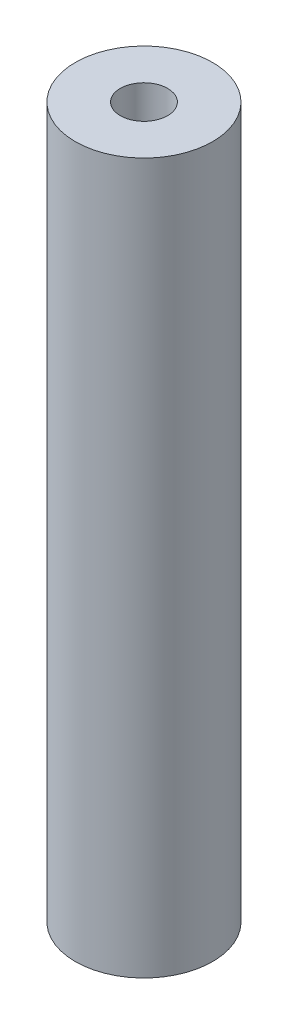
ISO-10303-21;
HEADER;
FILE_DESCRIPTION(('STEP AP214'),'2;1');
FILE_NAME('part.step','',(''),(''),'','','');
FILE_SCHEMA(('AUTOMOTIVE_DESIGN { 1 0 10303 214 1 1 1 1 }'));
ENDSEC;
DATA;
#1=APPLICATION_CONTEXT('core data for automotive mechanical design processes');
#2=APPLICATION_PROTOCOL_DEFINITION('international standard','automotive_design',2000,#1);
#3=PRODUCT_CONTEXT('',#1,'mechanical');
#4=PRODUCT('Part','Part','',(#3));
#5=PRODUCT_RELATED_PRODUCT_CATEGORY('part','',(#4));
#6=PRODUCT_DEFINITION_FORMATION('','',#4);
#7=PRODUCT_DEFINITION_CONTEXT('part definition',#1,'design');
#8=PRODUCT_DEFINITION('design','',#6,#7);
#9=PRODUCT_DEFINITION_SHAPE('','',#8);
#10=(LENGTH_UNIT() NAMED_UNIT(*) SI_UNIT(.MILLI.,.METRE.));
#11=(NAMED_UNIT(*) PLANE_ANGLE_UNIT() SI_UNIT($,.RADIAN.));
#12=(NAMED_UNIT(*) SI_UNIT($,.STERADIAN.) SOLID_ANGLE_UNIT());
#13=UNCERTAINTY_MEASURE_WITH_UNIT(LENGTH_MEASURE(1.E-05),#10,'distance_accuracy_value','');
#14=(GEOMETRIC_REPRESENTATION_CONTEXT(3) GLOBAL_UNCERTAINTY_ASSIGNED_CONTEXT((#13)) GLOBAL_UNIT_ASSIGNED_CONTEXT((#10,
#11,#12)) REPRESENTATION_CONTEXT('',''));
#15=CARTESIAN_POINT('',(0.,0.,0.));
#16=DIRECTION('',(0.,0.,1.));
#17=DIRECTION('',(1.,0.,0.));
#18=AXIS2_PLACEMENT_3D('',#15,#16,#17);
#19=CARTESIAN_POINT('',(-1.47902735159456,30.,-0.617821551931905));
#20=DIRECTION('',(0.,1.,0.));
#21=DIRECTION('',(0.,0.,1.));
#22=AXIS2_PLACEMENT_3D('',#19,#20,#21);
#23=PLANE('',#22);
#24=CARTESIAN_POINT('',(-1.47902735159456,30.,-0.617821551931905));
#25=DIRECTION('',(0.,1.,0.));
#26=DIRECTION('',(0.,0.,1.));
#27=AXIS2_PLACEMENT_3D('',#24,#25,#26);
#28=CIRCLE('',#27,2.9);
#29=CARTESIAN_POINT('',(-1.47902735159456,30.,2.2821784480681));
#30=VERTEX_POINT('',#29);
#31=EDGE_CURVE('E10',#30,#30,#28,.T.);
#32=ORIENTED_EDGE('',*,*,#31,.T.);
#33=EDGE_LOOP('',(#32));
#34=FACE_BOUND('',#33,.T.);
#35=CARTESIAN_POINT('',(-1.47902735159456,30.,-0.617821551931905));
#36=DIRECTION('',(0.,1.,0.));
#37=DIRECTION('',(0.,0.,1.));
#38=AXIS2_PLACEMENT_3D('',#35,#36,#37);
#39=CIRCLE('',#38,1.);
#40=CARTESIAN_POINT('',(-1.47902735159456,30.,0.382178448068095));
#41=VERTEX_POINT('',#40);
#42=EDGE_CURVE('E50',#41,#41,#39,.T.);
#43=ORIENTED_EDGE('',*,*,#42,.F.);
#44=EDGE_LOOP('',(#43));
#45=FACE_BOUND('',#44,.T.);
#46=ADVANCED_FACE('F37',(#34,#45),#23,.T.);
#47=CARTESIAN_POINT('',(-1.47902735159456,0.,-0.617821551931905));
#48=DIRECTION('',(0.,1.,0.));
#49=DIRECTION('',(0.,0.,1.));
#50=AXIS2_PLACEMENT_3D('',#47,#48,#49);
#51=PLANE('',#50);
#52=CARTESIAN_POINT('',(-1.47902735159456,0.,-0.617821551931905));
#53=DIRECTION('',(0.,1.,0.));
#54=DIRECTION('',(0.,0.,1.));
#55=AXIS2_PLACEMENT_3D('',#52,#53,#54);
#56=CIRCLE('',#55,2.9);
#57=CARTESIAN_POINT('',(-1.47902735159456,0.,2.2821784480681));
#58=VERTEX_POINT('',#57);
#59=EDGE_CURVE('E41',#58,#58,#56,.T.);
#60=ORIENTED_EDGE('',*,*,#59,.F.);
#61=EDGE_LOOP('',(#60));
#62=FACE_BOUND('',#61,.T.);
#63=CARTESIAN_POINT('',(-1.47902735159456,0.,-0.617821551931905));
#64=DIRECTION('',(0.,1.,0.));
#65=DIRECTION('',(0.,0.,1.));
#66=AXIS2_PLACEMENT_3D('',#63,#64,#65);
#67=CIRCLE('',#66,1.);
#68=CARTESIAN_POINT('',(-1.47902735159456,0.,0.382178448068095));
#69=VERTEX_POINT('',#68);
#70=EDGE_CURVE('E52',#69,#69,#67,.T.);
#71=ORIENTED_EDGE('',*,*,#70,.T.);
#72=EDGE_LOOP('',(#71));
#73=FACE_BOUND('',#72,.T.);
#74=ADVANCED_FACE('F64',(#62,#73),#51,.F.);
#75=CARTESIAN_POINT('',(-1.47902735159456,30.,-0.617821551931905));
#76=DIRECTION('',(0.,-1.,0.));
#77=DIRECTION('',(0.,0.,-1.));
#78=AXIS2_PLACEMENT_3D('',#75,#76,#77);
#79=CYLINDRICAL_SURFACE('',#78,2.9);
#80=ORIENTED_EDGE('',*,*,#31,.F.);
#81=EDGE_LOOP('',(#80));
#82=FACE_BOUND('',#81,.T.);
#83=ORIENTED_EDGE('',*,*,#59,.T.);
#84=EDGE_LOOP('',(#83));
#85=FACE_BOUND('',#84,.T.);
#86=ADVANCED_FACE('F39',(#82,#85),#79,.T.);
#87=CARTESIAN_POINT('',(-1.47902735159456,30.,-0.617821551931905));
#88=DIRECTION('',(0.,-1.,0.));
#89=DIRECTION('',(0.,0.,-1.));
#90=AXIS2_PLACEMENT_3D('',#87,#88,#89);
#91=CYLINDRICAL_SURFACE('',#90,1.);
#92=ORIENTED_EDGE('',*,*,#42,.T.);
#93=EDGE_LOOP('',(#92));
#94=FACE_BOUND('',#93,.T.);
#95=ORIENTED_EDGE('',*,*,#70,.F.);
#96=EDGE_LOOP('',(#95));
#97=FACE_BOUND('',#96,.T.);
#98=ADVANCED_FACE('F60',(#94,#97),#91,.F.);
#99=CLOSED_SHELL('',(#46,#74,#86,#98));
#100=MANIFOLD_SOLID_BREP('B2',#99);
#101=ADVANCED_BREP_SHAPE_REPRESENTATION('',(#18,#100),#14);
#102=SHAPE_DEFINITION_REPRESENTATION(#9,#101);
ENDSEC;
END-ISO-10303-21;
